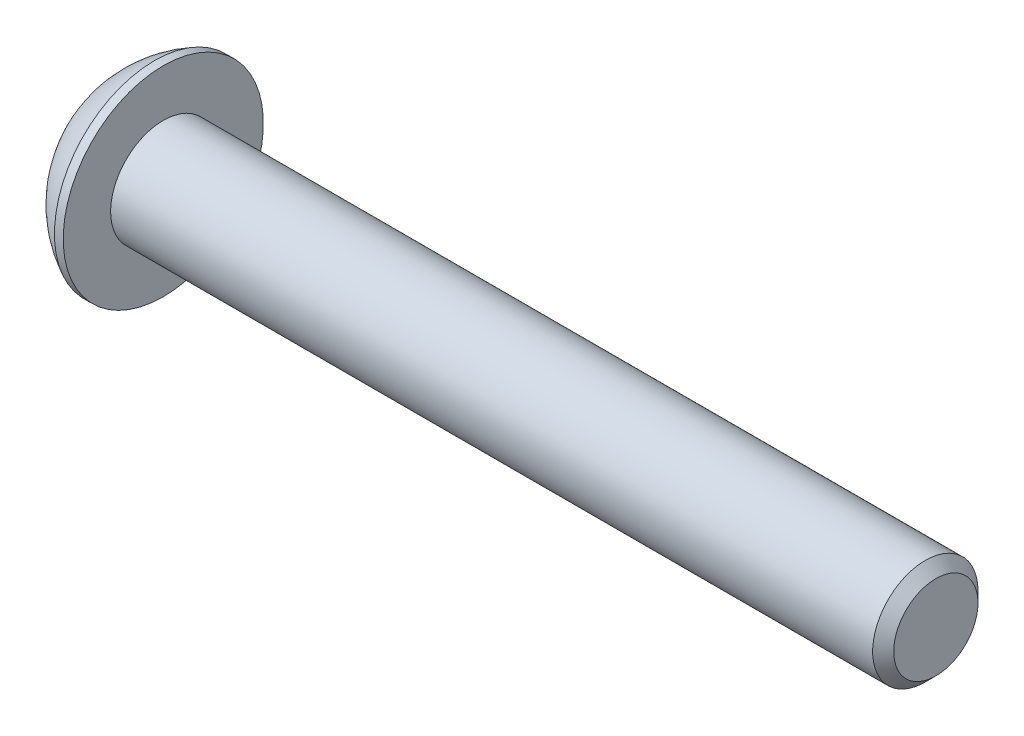
ISO-10303-21;
HEADER;
FILE_DESCRIPTION(('STEP AP214'),'2;1');
FILE_NAME('part.step','',(''),(''),'','','');
FILE_SCHEMA(('AUTOMOTIVE_DESIGN { 1 0 10303 214 1 1 1 1 }'));
ENDSEC;
DATA;
#1=APPLICATION_CONTEXT('core data for automotive mechanical design processes');
#2=APPLICATION_PROTOCOL_DEFINITION('international standard','automotive_design',2000,#1);
#3=PRODUCT_CONTEXT('',#1,'mechanical');
#4=PRODUCT('Part','Part','',(#3));
#5=PRODUCT_RELATED_PRODUCT_CATEGORY('part','',(#4));
#6=PRODUCT_DEFINITION_FORMATION('','',#4);
#7=PRODUCT_DEFINITION_CONTEXT('part definition',#1,'design');
#8=PRODUCT_DEFINITION('design','',#6,#7);
#9=PRODUCT_DEFINITION_SHAPE('','',#8);
#10=(LENGTH_UNIT() NAMED_UNIT(*) SI_UNIT(.MILLI.,.METRE.));
#11=(NAMED_UNIT(*) PLANE_ANGLE_UNIT() SI_UNIT($,.RADIAN.));
#12=(NAMED_UNIT(*) SI_UNIT($,.STERADIAN.) SOLID_ANGLE_UNIT());
#13=UNCERTAINTY_MEASURE_WITH_UNIT(LENGTH_MEASURE(1.E-05),#10,'distance_accuracy_value','');
#14=(GEOMETRIC_REPRESENTATION_CONTEXT(3) GLOBAL_UNCERTAINTY_ASSIGNED_CONTEXT((#13)) GLOBAL_UNIT_ASSIGNED_CONTEXT((#10,
#11,#12)) REPRESENTATION_CONTEXT('',''));
#15=CARTESIAN_POINT('',(0.,0.,0.));
#16=DIRECTION('',(0.,0.,1.));
#17=DIRECTION('',(1.,0.,0.));
#18=AXIS2_PLACEMENT_3D('',#15,#16,#17);
#19=CARTESIAN_POINT('',(-22.,0.,0.));
#20=DIRECTION('',(1.,0.,0.));
#21=DIRECTION('',(0.,0.,-1.));
#22=AXIS2_PLACEMENT_3D('',#19,#20,#21);
#23=CYLINDRICAL_SURFACE('',#22,1.5);
#24=CARTESIAN_POINT('',(-0.300000000000002,0.,0.));
#25=DIRECTION('',(1.,0.,0.));
#26=DIRECTION('',(0.,0.,-1.));
#27=AXIS2_PLACEMENT_3D('',#24,#25,#26);
#28=CIRCLE('',#27,1.5);
#29=CARTESIAN_POINT('',(-0.300000000000002,0.,-1.5));
#30=VERTEX_POINT('',#29);
#31=EDGE_CURVE('E47',#30,#30,#28,.F.);
#32=ORIENTED_EDGE('',*,*,#31,.T.);
#33=EDGE_LOOP('',(#32));
#34=FACE_BOUND('',#33,.T.);
#35=CARTESIAN_POINT('',(-22.,0.,0.));
#36=DIRECTION('',(-1.,0.,0.));
#37=DIRECTION('',(0.,-1.,0.));
#38=AXIS2_PLACEMENT_3D('',#35,#36,#37);
#39=CIRCLE('',#38,1.5);
#40=CARTESIAN_POINT('',(-22.,-1.50000000000001,0.));
#41=VERTEX_POINT('',#40);
#42=EDGE_CURVE('E130',#41,#41,#39,.F.);
#43=ORIENTED_EDGE('',*,*,#42,.T.);
#44=EDGE_LOOP('',(#43));
#45=FACE_BOUND('',#44,.T.);
#46=ADVANCED_FACE('F34',(#34,#45),#23,.T.);
#47=CARTESIAN_POINT('',(0.,0.,0.));
#48=DIRECTION('',(1.,0.,0.));
#49=DIRECTION('',(0.,0.,-1.));
#50=AXIS2_PLACEMENT_3D('',#47,#48,#49);
#51=PLANE('',#50);
#52=CARTESIAN_POINT('',(0.,0.,0.));
#53=DIRECTION('',(1.,0.,0.));
#54=DIRECTION('',(0.,0.,-1.));
#55=AXIS2_PLACEMENT_3D('',#52,#53,#54);
#56=CIRCLE('',#55,1.2);
#57=CARTESIAN_POINT('',(0.,0.,-1.2));
#58=VERTEX_POINT('',#57);
#59=EDGE_CURVE('E134',#58,#58,#56,.T.);
#60=ORIENTED_EDGE('',*,*,#59,.T.);
#61=EDGE_LOOP('',(#60));
#62=FACE_BOUND('',#61,.T.);
#63=ADVANCED_FACE('F149',(#62),#51,.T.);
#64=CARTESIAN_POINT('',(0.,0.,0.));
#65=DIRECTION('',(-1.,0.,0.));
#66=DIRECTION('',(0.,0.,1.));
#67=AXIS2_PLACEMENT_3D('',#64,#65,#66);
#68=CONICAL_SURFACE('',#67,1.2,0.785398163397452);
#69=ORIENTED_EDGE('',*,*,#31,.F.);
#70=EDGE_LOOP('',(#69));
#71=FACE_BOUND('',#70,.T.);
#72=ORIENTED_EDGE('',*,*,#59,.F.);
#73=EDGE_LOOP('',(#72));
#74=FACE_BOUND('',#73,.T.);
#75=ADVANCED_FACE('F36',(#71,#74),#68,.T.);
#76=CARTESIAN_POINT('',(-23.65,0.,0.));
#77=DIRECTION('',(1.,0.,0.));
#78=DIRECTION('',(0.,1.,0.));
#79=AXIS2_PLACEMENT_3D('',#76,#77,#78);
#80=PLANE('',#79);
#81=CARTESIAN_POINT('',(-23.65,0.,0.));
#82=DIRECTION('',(-1.,0.,0.));
#83=DIRECTION('',(0.,-1.,0.));
#84=AXIS2_PLACEMENT_3D('',#81,#82,#83);
#85=CIRCLE('',#84,1.20470053837926);
#86=CARTESIAN_POINT('',(-23.65,-1.20470053837928,0.));
#87=VERTEX_POINT('',#86);
#88=EDGE_CURVE('E372',#87,#87,#85,.T.);
#89=ORIENTED_EDGE('',*,*,#88,.F.);
#90=EDGE_LOOP('',(#89));
#91=FACE_BOUND('',#90,.T.);
#92=CARTESIAN_POINT('',(-23.65,0.,0.));
#93=DIRECTION('',(-1.,0.,0.));
#94=DIRECTION('',(0.,-1.,0.));
#95=AXIS2_PLACEMENT_3D('',#92,#93,#94);
#96=CIRCLE('',#95,1.5);
#97=CARTESIAN_POINT('',(-23.65,-1.5,0.));
#98=VERTEX_POINT('',#97);
#99=EDGE_CURVE('E126',#98,#98,#96,.T.);
#100=ORIENTED_EDGE('',*,*,#99,.T.);
#101=EDGE_LOOP('',(#100));
#102=FACE_BOUND('',#101,.T.);
#103=ADVANCED_FACE('F148',(#91,#102),#80,.F.);
#104=CARTESIAN_POINT('',(-20.8526785714286,0.,0.));
#105=DIRECTION('',(-1.,0.,0.));
#106=DIRECTION('',(0.,1.,0.));
#107=AXIS2_PLACEMENT_3D('',#104,#105,#106);
#108=SPHERICAL_SURFACE('',#107,3.17411517981703);
#109=ORIENTED_EDGE('',*,*,#99,.F.);
#110=EDGE_LOOP('',(#109));
#111=FACE_BOUND('',#110,.T.);
#112=CARTESIAN_POINT('',(-22.25,0.,0.));
#113=DIRECTION('',(-1.,0.,0.));
#114=DIRECTION('',(0.,-1.,0.));
#115=AXIS2_PLACEMENT_3D('',#112,#113,#114);
#116=CIRCLE('',#115,2.85);
#117=CARTESIAN_POINT('',(-22.25,-2.85,0.));
#118=VERTEX_POINT('',#117);
#119=EDGE_CURVE('E122',#118,#118,#116,.T.);
#120=ORIENTED_EDGE('',*,*,#119,.T.);
#121=EDGE_LOOP('',(#120));
#122=FACE_BOUND('',#121,.T.);
#123=ADVANCED_FACE('F160',(#111,#122),#108,.T.);
#124=CARTESIAN_POINT('',(-22.,0.,0.));
#125=DIRECTION('',(-1.,0.,0.));
#126=DIRECTION('',(0.,-1.,0.));
#127=AXIS2_PLACEMENT_3D('',#124,#125,#126);
#128=CYLINDRICAL_SURFACE('',#127,2.85);
#129=ORIENTED_EDGE('',*,*,#119,.F.);
#130=EDGE_LOOP('',(#129));
#131=FACE_BOUND('',#130,.T.);
#132=CARTESIAN_POINT('',(-22.,0.,0.));
#133=DIRECTION('',(-1.,0.,0.));
#134=DIRECTION('',(0.,-1.,0.));
#135=AXIS2_PLACEMENT_3D('',#132,#133,#134);
#136=CIRCLE('',#135,2.85);
#137=CARTESIAN_POINT('',(-22.,-2.85,0.));
#138=VERTEX_POINT('',#137);
#139=EDGE_CURVE('E118',#138,#138,#136,.T.);
#140=ORIENTED_EDGE('',*,*,#139,.T.);
#141=EDGE_LOOP('',(#140));
#142=FACE_BOUND('',#141,.T.);
#143=ADVANCED_FACE('F164',(#131,#142),#128,.T.);
#144=CARTESIAN_POINT('',(-22.,2.85,0.));
#145=DIRECTION('',(-1.,0.,0.));
#146=DIRECTION('',(0.,-1.,0.));
#147=AXIS2_PLACEMENT_3D('',#144,#145,#146);
#148=PLANE('',#147);
#149=ORIENTED_EDGE('',*,*,#42,.F.);
#150=EDGE_LOOP('',(#149));
#151=FACE_BOUND('',#150,.T.);
#152=ORIENTED_EDGE('',*,*,#139,.F.);
#153=EDGE_LOOP('',(#152));
#154=FACE_BOUND('',#153,.T.);
#155=ADVANCED_FACE('F168',(#151,#154),#148,.F.);
#156=CARTESIAN_POINT('',(-23.65,0.,0.));
#157=DIRECTION('',(-1.,0.,0.));
#158=DIRECTION('',(0.,-1.,0.));
#159=AXIS2_PLACEMENT_3D('',#156,#157,#158);
#160=CONICAL_SURFACE('',#159,1.20470053837926,0.78539816339745);
#161=ORIENTED_EDGE('',*,*,#88,.T.);
#162=EDGE_LOOP('',(#161));
#163=FACE_BOUND('',#162,.T.);
#164=CARTESIAN_POINT('',(-24.0125645579163,-1.20678079288098,1.));
#165=CARTESIAN_POINT('',(-23.9901238799752,-1.1776323938094,1.));
#166=CARTESIAN_POINT('',(-23.9678867609271,-1.1483277765504,1.));
#167=CARTESIAN_POINT('',(-23.9239053230859,-1.08934073997342,1.));
#168=CARTESIAN_POINT('',(-23.902161120887,-1.05965823380998,1.));
#169=CARTESIAN_POINT('',(-23.8374858802222,-0.969511619364399,1.));
#170=CARTESIAN_POINT('',(-23.795456442765,-0.908390032886429,1.));
#171=CARTESIAN_POINT('',(-23.7124203349119,-0.779849899214053,1.));
#172=CARTESIAN_POINT('',(-23.6716484956871,-0.71227804773398,1.));
#173=CARTESIAN_POINT('',(-23.5967056855402,-0.573692441836196,1.));
#174=CARTESIAN_POINT('',(-23.5625124208036,-0.502691370033607,1.));
#175=CARTESIAN_POINT('',(-23.5206648240494,-0.396633108483685,1.));
#176=CARTESIAN_POINT('',(-23.508752424601,-0.363265114723113,1.));
#177=CARTESIAN_POINT('',(-23.4876010580815,-0.29567514486371,1.));
#178=CARTESIAN_POINT('',(-23.4783622608543,-0.26145311466105,1.));
#179=CARTESIAN_POINT('',(-23.4632108375931,-0.192964714439445,1.));
#180=CARTESIAN_POINT('',(-23.4572372079353,-0.15871206270245,1.));
#181=CARTESIAN_POINT('',(-23.4487381792859,-0.0897678989598084,1.));
#182=CARTESIAN_POINT('',(-23.4462131691607,-0.0550763379078104,1.));
#183=CARTESIAN_POINT('',(-23.4448308242394,0.0128534343371815,1.));
#184=CARTESIAN_POINT('',(-23.4458171333425,0.0460884918414469,1.));
#185=CARTESIAN_POINT('',(-23.4510428296463,0.112288777523335,1.));
#186=CARTESIAN_POINT('',(-23.4552814228284,0.145254069576908,1.));
#187=CARTESIAN_POINT('',(-23.4668431932388,0.211252641710455,1.));
#188=CARTESIAN_POINT('',(-23.4742213991969,0.244276126106397,1.));
#189=CARTESIAN_POINT('',(-23.4916537633013,0.309593416178887,1.));
#190=CARTESIAN_POINT('',(-23.5017077720937,0.341887262472118,1.));
#191=CARTESIAN_POINT('',(-23.5364692676108,0.441188556116696,1.));
#192=CARTESIAN_POINT('',(-23.5650343603337,0.506841480843466,1.));
#193=CARTESIAN_POINT('',(-23.6286033694253,0.635081389212351,1.));
#194=CARTESIAN_POINT('',(-23.663629955309,0.697656564069511,1.));
#195=CARTESIAN_POINT('',(-23.7359546107891,0.8172743696946,1.));
#196=CARTESIAN_POINT('',(-23.7730556162911,0.874437672313569,1.));
#197=CARTESIAN_POINT('',(-23.8304371678966,0.958655710303473,1.));
#198=CARTESIAN_POINT('',(-23.8497720189249,0.98636616376694,1.));
#199=CARTESIAN_POINT('',(-23.8889602713879,1.04140691974408,1.));
#200=CARTESIAN_POINT('',(-23.908813529201,1.0687373243988,1.));
#201=CARTESIAN_POINT('',(-23.92888195229,1.09590921458868,1.));
#202=B_SPLINE_CURVE_WITH_KNOTS('',3,(#164,#165,#166,#167,#168,#169,#170,#171,#172,#173,#174,
#175,#176,#177,#178,#179,#180,#181,#182,#183,#184,#185,#186,#187,#188,#189,#190,#191,#192,#193,
#194,#195,#196,#197,#198,#199,#200,#201),.UNSPECIFIED.,.F.,.F.,(4,2,2,2,2,2,2,2,2,2,2,2,2,2,2,2,
2,2,4),(0.,0.110355487284534,0.220736811203829,0.443178348562915,0.67975933518112,
0.915523888816468,1.02172703810025,1.1279369325962,1.23208803653003,1.33625088357217,
1.43583459192535,1.53539399546241,1.63677534642524,1.73815103982916,1.95232008261278,
2.16725532249797,2.37159620059983,2.47295962852456,2.57429526618464),.UNSPECIFIED.);
#203=CARTESIAN_POINT('',(-23.6,-0.577350269189646,1.));
#204=VERTEX_POINT('',#203);
#205=CARTESIAN_POINT('',(-23.6,0.577350269189605,1.));
#206=VERTEX_POINT('',#205);
#207=EDGE_CURVE('E102',#204,#206,#202,.T.);
#208=ORIENTED_EDGE('',*,*,#207,.F.);
#209=CARTESIAN_POINT('',(-23.6001154873726,-1.15481600843311,-0.000200000000000284));
#210=CARTESIAN_POINT('',(-23.5802779308257,-1.13496520795028,0.0341825950071803));
#211=CARTESIAN_POINT('',(-23.5616050206389,-1.11478247255944,0.0691401181398242));
#212=CARTESIAN_POINT('',(-23.5274147427231,-1.07362739529221,0.140422802956089));
#213=CARTESIAN_POINT('',(-23.5119164090234,-1.05265113558082,0.176754750528983));
#214=CARTESIAN_POINT('',(-23.4853673071423,-1.01035337909805,0.250016613803311));
#215=CARTESIAN_POINT('',(-23.4742497739969,-0.989042666109261,0.286927851445414));
#216=CARTESIAN_POINT('',(-23.4571198657762,-0.945952199282712,0.361562729310859));
#217=CARTESIAN_POINT('',(-23.4510946974667,-0.924173762626617,0.399284088108635));
#218=CARTESIAN_POINT('',(-23.4456605549675,-0.886641312640035,0.464292198417933));
#219=CARTESIAN_POINT('',(-23.4448569383167,-0.870936130672296,0.491494371528172));
#220=CARTESIAN_POINT('',(-23.4462066994169,-0.839556179862869,0.545846040669111));
#221=CARTESIAN_POINT('',(-23.4483607295472,-0.823881418494944,0.572995523754875));
#222=CARTESIAN_POINT('',(-23.4591169721285,-0.777080970599387,0.65405627732696));
#223=CARTESIAN_POINT('',(-23.4720145564153,-0.746188191116451,0.707564140978427));
#224=CARTESIAN_POINT('',(-23.5031407306022,-0.691968116419669,0.801476065143432));
#225=CARTESIAN_POINT('',(-23.5197377977018,-0.668386557293391,0.842320523671835));
#226=CARTESIAN_POINT('',(-23.5571249246853,-0.622147085933701,0.922409637381944));
#227=CARTESIAN_POINT('',(-23.5779013418174,-0.599486449584595,0.961659010870437));
#228=CARTESIAN_POINT('',(-23.6001154873726,-0.577234799135809,1.0002));
#229=B_SPLINE_CURVE_WITH_KNOTS('',3,(#209,#210,#211,#212,#213,#214,#215,#216,#217,#218,#219,
#220,#221,#222,#223,#224,#225,#226,#227,#228),.UNSPECIFIED.,.F.,.F.,(4,2,2,2,2,2,2,2,2,4),(0.,
0.133237676828558,0.267252229834489,0.399137076269299,0.530689603280767,0.624814864263845,
0.718960890149132,0.907306626112097,1.0571010036179,1.20641411519286),.UNSPECIFIED.);
#230=CARTESIAN_POINT('',(-23.6,-1.15470053837927,0.));
#231=VERTEX_POINT('',#230);
#232=EDGE_CURVE('E210',#231,#204,#229,.T.);
#233=ORIENTED_EDGE('',*,*,#232,.F.);
#234=CARTESIAN_POINT('',(-23.6001154873726,-0.577234799135808,-1.0002));
#235=CARTESIAN_POINT('',(-23.5802779308257,-0.597085599618641,-0.96581740499282));
#236=CARTESIAN_POINT('',(-23.5616050206389,-0.617268335009476,-0.930859881860175));
#237=CARTESIAN_POINT('',(-23.5274147427231,-0.658423412276706,-0.85957719704391));
#238=CARTESIAN_POINT('',(-23.5119164090234,-0.6793996719881,-0.823245249471016));
#239=CARTESIAN_POINT('',(-23.4853673071423,-0.721697428470867,-0.749983386196689));
#240=CARTESIAN_POINT('',(-23.4742497739969,-0.743008141459657,-0.713072148554586));
#241=CARTESIAN_POINT('',(-23.4571198657762,-0.786098608286206,-0.638437270689141));
#242=CARTESIAN_POINT('',(-23.4510946974667,-0.807877044942301,-0.600715911891364));
#243=CARTESIAN_POINT('',(-23.4456605549675,-0.845409494928883,-0.535707801582066));
#244=CARTESIAN_POINT('',(-23.4448569383167,-0.861114676896622,-0.508505628471828));
#245=CARTESIAN_POINT('',(-23.4462066994169,-0.892494627706049,-0.454153959330888));
#246=CARTESIAN_POINT('',(-23.4483607295472,-0.908169389073974,-0.427004476245124));
#247=CARTESIAN_POINT('',(-23.4591169721285,-0.954969836969531,-0.34594372267304));
#248=CARTESIAN_POINT('',(-23.4720145564153,-0.985862616452468,-0.292435859021572));
#249=CARTESIAN_POINT('',(-23.5031407306022,-1.04008269114925,-0.198523934856568));
#250=CARTESIAN_POINT('',(-23.5197377977018,-1.06366425027553,-0.157679476328166));
#251=CARTESIAN_POINT('',(-23.5571249246853,-1.10990372163522,-0.0775903626180571));
#252=CARTESIAN_POINT('',(-23.5779013418174,-1.13256435798432,-0.0383409891295633));
#253=CARTESIAN_POINT('',(-23.6001154873726,-1.15481600843311,0.000199999999999115));
#254=B_SPLINE_CURVE_WITH_KNOTS('',3,(#234,#235,#236,#237,#238,#239,#240,#241,#242,#243,#244,
#245,#246,#247,#248,#249,#250,#251,#252,#253),.UNSPECIFIED.,.F.,.F.,(4,2,2,2,2,2,2,2,2,4),(0.,
0.13323767682856,0.267252229834489,0.399137076269299,0.530689603280768,0.624814864263846,
0.718960890149132,0.907306626112097,1.05710100361789,1.20641411519286),.UNSPECIFIED.);
#255=CARTESIAN_POINT('',(-23.6,-0.577350269189646,-1.));
#256=VERTEX_POINT('',#255);
#257=EDGE_CURVE('E205',#256,#231,#254,.T.);
#258=ORIENTED_EDGE('',*,*,#257,.F.);
#259=CARTESIAN_POINT('',(-24.0125650614172,-1.20678144678533,-1.));
#260=CARTESIAN_POINT('',(-23.9901243639822,-1.17763302882146,-1.));
#261=CARTESIAN_POINT('',(-23.9678872254711,-1.14832839261354,-1.));
#262=CARTESIAN_POINT('',(-23.9239057488155,-1.08934131795807,-1.));
#263=CARTESIAN_POINT('',(-23.9021615272652,-1.059658792665,-1.));
#264=CARTESIAN_POINT('',(-23.837486228163,-0.969512119697562,-1.));
#265=CARTESIAN_POINT('',(-23.7954567519025,-0.908390493450879,-1.));
#266=CARTESIAN_POINT('',(-23.7124205639502,-0.779850272991524,-1.));
#267=CARTESIAN_POINT('',(-23.67164868372,-0.712278374260663,-1.));
#268=CARTESIAN_POINT('',(-23.5967057974366,-0.573692669877708,-1.));
#269=CARTESIAN_POINT('',(-23.5625124975185,-0.502691546874024,-1.));
#270=CARTESIAN_POINT('',(-23.5206648756311,-0.396633247078009,-1.));
#271=CARTESIAN_POINT('',(-23.5087524781389,-0.363265269879175,-1.));
#272=CARTESIAN_POINT('',(-23.4876011122146,-0.295675333788417,-1.));
#273=CARTESIAN_POINT('',(-23.4783623136284,-0.261453320792008,-1.));
#274=CARTESIAN_POINT('',(-23.4632108836686,-0.192964954456364,-1.));
#275=CARTESIAN_POINT('',(-23.4572372487852,-0.158712319385996,-1.));
#276=CARTESIAN_POINT('',(-23.4487382057865,-0.0897681885430111,-1.));
#277=CARTESIAN_POINT('',(-23.446213186537,-0.05507664372401,-1.));
#278=CARTESIAN_POINT('',(-23.4448308203586,0.0128531008985226,-1.));
#279=CARTESIAN_POINT('',(-23.445817117779,0.0460881469709354,-1.));
#280=CARTESIAN_POINT('',(-23.4510427890575,0.112288411077507,-1.));
#281=CARTESIAN_POINT('',(-23.4552813688957,0.14525369298744,-1.));
#282=CARTESIAN_POINT('',(-23.4668431114854,0.211252245100392,-1.));
#283=CARTESIAN_POINT('',(-23.474221302878,0.244275719655881,-1.));
#284=CARTESIAN_POINT('',(-23.4916536376949,0.309592991103803,-1.));
#285=CARTESIAN_POINT('',(-23.5017076317658,0.341886828612767,-1.));
#286=CARTESIAN_POINT('',(-23.5364690589811,0.441188030105094,-1.));
#287=CARTESIAN_POINT('',(-23.5650340890574,0.506840876086047,-1.));
#288=CARTESIAN_POINT('',(-23.6286029659001,0.635080633024404,-1.));
#289=CARTESIAN_POINT('',(-23.663629482132,0.697655735233984,-1.));
#290=CARTESIAN_POINT('',(-23.7359540043354,0.817273410459762,-1.));
#291=CARTESIAN_POINT('',(-23.7730549468408,0.874436654853316,-1.));
#292=CARTESIAN_POINT('',(-23.8304364042781,0.958654606765343,-1.));
#293=CARTESIAN_POINT('',(-23.8497712241667,0.98636503195223,-1.));
#294=CARTESIAN_POINT('',(-23.8889594143893,1.04140573156298,-1.));
#295=CARTESIAN_POINT('',(-23.9088126411017,1.06873610812793,-1.));
#296=CARTESIAN_POINT('',(-23.9288810331298,1.09590797027906,-1.));
#297=B_SPLINE_CURVE_WITH_KNOTS('',3,(#259,#260,#261,#262,#263,#264,#265,#266,#267,#268,#269,
#270,#271,#272,#273,#274,#275,#276,#277,#278,#279,#280,#281,#282,#283,#284,#285,#286,#287,#288,
#289,#290,#291,#292,#293,#294,#295,#296),.UNSPECIFIED.,.F.,.F.,(4,2,2,2,2,2,2,2,2,2,2,2,2,2,2,2,
2,2,4),(0.,0.110355567866854,0.220736972391891,0.44317867397924,0.679759845471899,
0.915524582194851,1.02172768288056,1.12793752886233,1.23208858652571,1.33625138728838,
1.43583506047458,1.53539442879914,1.63677574143709,1.73815139653142,1.95232014898535,
2.16725509662759,2.3715957252827,2.47295903017567,2.57429454481414),.UNSPECIFIED.);
#298=CARTESIAN_POINT('',(-23.6,0.577350269189606,-1.));
#299=VERTEX_POINT('',#298);
#300=EDGE_CURVE('E54',#299,#256,#297,.F.);
#301=ORIENTED_EDGE('',*,*,#300,.F.);
#302=CARTESIAN_POINT('',(-23.6001154873726,1.15481600843307,0.000200000000000217));
#303=CARTESIAN_POINT('',(-23.5802779308257,1.13496520795024,-0.0341825950071804));
#304=CARTESIAN_POINT('',(-23.5616050206389,1.1147824725594,-0.0691401181398242));
#305=CARTESIAN_POINT('',(-23.5274147427231,1.07362739529217,-0.140422802956089));
#306=CARTESIAN_POINT('',(-23.5119164090234,1.05265113558078,-0.176754750528983));
#307=CARTESIAN_POINT('',(-23.4853673071423,1.01035337909801,-0.25001661380331));
#308=CARTESIAN_POINT('',(-23.4742497739969,0.98904266610922,-0.286927851445414));
#309=CARTESIAN_POINT('',(-23.4571198657762,0.945952199282671,-0.361562729310859));
#310=CARTESIAN_POINT('',(-23.4510946974667,0.924173762626576,-0.399284088108635));
#311=CARTESIAN_POINT('',(-23.4456605549675,0.886641312639994,-0.464292198417933));
#312=CARTESIAN_POINT('',(-23.4448569383167,0.870936130672255,-0.491494371528172));
#313=CARTESIAN_POINT('',(-23.4462066994169,0.839556179862828,-0.545846040669112));
#314=CARTESIAN_POINT('',(-23.4483607295472,0.823881418494903,-0.572995523754875));
#315=CARTESIAN_POINT('',(-23.4591169721285,0.777080970599346,-0.65405627732696));
#316=CARTESIAN_POINT('',(-23.4720145564153,0.74618819111641,-0.707564140978427));
#317=CARTESIAN_POINT('',(-23.5031407306022,0.691968116419629,-0.801476065143431));
#318=CARTESIAN_POINT('',(-23.5197377977018,0.668386557293351,-0.842320523671834));
#319=CARTESIAN_POINT('',(-23.5571249246853,0.622147085933661,-0.922409637381944));
#320=CARTESIAN_POINT('',(-23.5779013418174,0.599486449584555,-0.961659010870438));
#321=CARTESIAN_POINT('',(-23.6001154873726,0.577234799135768,-1.0002));
#322=B_SPLINE_CURVE_WITH_KNOTS('',3,(#302,#303,#304,#305,#306,#307,#308,#309,#310,#311,#312,
#313,#314,#315,#316,#317,#318,#319,#320,#321),.UNSPECIFIED.,.F.,.F.,(4,2,2,2,2,2,2,2,2,4),(0.,
0.133237676828557,0.267252229834489,0.399137076269299,0.530689603280767,0.624814864263845,
0.718960890149132,0.907306626112097,1.05710100361789,1.20641411519286),.UNSPECIFIED.);
#323=CARTESIAN_POINT('',(-23.6,1.15470053837923,0.));
#324=VERTEX_POINT('',#323);
#325=EDGE_CURVE('E11',#324,#299,#322,.T.);
#326=ORIENTED_EDGE('',*,*,#325,.F.);
#327=CARTESIAN_POINT('',(-23.6001154873726,0.577234799135767,1.0002));
#328=CARTESIAN_POINT('',(-23.5802779308257,0.5970855996186,0.96581740499282));
#329=CARTESIAN_POINT('',(-23.5616050206389,0.617268335009435,0.930859881860176));
#330=CARTESIAN_POINT('',(-23.5274147427231,0.658423412276665,0.859577197043911));
#331=CARTESIAN_POINT('',(-23.5119164090234,0.679399671988059,0.823245249471016));
#332=CARTESIAN_POINT('',(-23.4853673071423,0.721697428470826,0.749983386196689));
#333=CARTESIAN_POINT('',(-23.4742497739969,0.743008141459616,0.713072148554586));
#334=CARTESIAN_POINT('',(-23.4571198657762,0.786098608286166,0.638437270689141));
#335=CARTESIAN_POINT('',(-23.4510946974667,0.807877044942261,0.600715911891364));
#336=CARTESIAN_POINT('',(-23.4456605549675,0.845409494928843,0.535707801582066));
#337=CARTESIAN_POINT('',(-23.4448569383167,0.861114676896582,0.508505628471827));
#338=CARTESIAN_POINT('',(-23.4462066994169,0.892494627706009,0.454153959330887));
#339=CARTESIAN_POINT('',(-23.4483607295472,0.908169389073934,0.427004476245123));
#340=CARTESIAN_POINT('',(-23.4591169721285,0.954969836969491,0.345943722673039));
#341=CARTESIAN_POINT('',(-23.4720145564153,0.985862616452427,0.292435859021572));
#342=CARTESIAN_POINT('',(-23.5031407306022,1.04008269114921,0.198523934856567));
#343=CARTESIAN_POINT('',(-23.5197377977018,1.06366425027549,0.157679476328164));
#344=CARTESIAN_POINT('',(-23.5571249246853,1.10990372163518,0.0775903626180551));
#345=CARTESIAN_POINT('',(-23.5779013418174,1.13256435798428,0.038340989129562));
#346=CARTESIAN_POINT('',(-23.6001154873726,1.15481600843307,-0.000199999999999525));
#347=B_SPLINE_CURVE_WITH_KNOTS('',3,(#327,#328,#329,#330,#331,#332,#333,#334,#335,#336,#337,
#338,#339,#340,#341,#342,#343,#344,#345,#346),.UNSPECIFIED.,.F.,.F.,(4,2,2,2,2,2,2,2,2,4),(0.,
0.133237676828559,0.267252229834489,0.399137076269299,0.530689603280768,0.624814864263846,
0.718960890149133,0.907306626112098,1.0571010036179,1.20641411519286),.UNSPECIFIED.);
#348=EDGE_CURVE('E92',#206,#324,#347,.T.);
#349=ORIENTED_EDGE('',*,*,#348,.F.);
#350=EDGE_LOOP('',(#208,#233,#258,#301,#326,#349));
#351=FACE_BOUND('',#350,.T.);
#352=ADVANCED_FACE('F91',(#163,#351),#160,.F.);
#353=CARTESIAN_POINT('',(-22.45,0.,0.));
#354=DIRECTION('',(-1.,0.,0.));
#355=DIRECTION('',(0.,0.,1.));
#356=AXIS2_PLACEMENT_3D('',#353,#354,#355);
#357=PLANE('',#356);
#358=DIRECTION('',(0.,0.5,-0.866025403784439));
#359=VECTOR('',#358,1.);
#360=CARTESIAN_POINT('',(-22.45,0.577350269189605,1.));
#361=LINE('',#360,#359);
#362=CARTESIAN_POINT('',(-22.45,0.577350269189605,1.));
#363=VERTEX_POINT('',#362);
#364=CARTESIAN_POINT('',(-22.45,1.15470053837923,0.));
#365=VERTEX_POINT('',#364);
#366=EDGE_CURVE('E101',#363,#365,#361,.T.);
#367=ORIENTED_EDGE('',*,*,#366,.T.);
#368=DIRECTION('',(0.,-0.5,-0.866025403784439));
#369=VECTOR('',#368,1.);
#370=CARTESIAN_POINT('',(-22.45,1.15470053837923,0.));
#371=LINE('',#370,#369);
#372=CARTESIAN_POINT('',(-22.45,0.577350269189605,-1.));
#373=VERTEX_POINT('',#372);
#374=EDGE_CURVE('E106',#365,#373,#371,.T.);
#375=ORIENTED_EDGE('',*,*,#374,.T.);
#376=DIRECTION('',(0.,-1.,0.));
#377=VECTOR('',#376,1.);
#378=CARTESIAN_POINT('',(-22.45,0.577350269189605,-1.));
#379=LINE('',#378,#377);
#380=CARTESIAN_POINT('',(-22.45,-0.577350269189646,-1.));
#381=VERTEX_POINT('',#380);
#382=EDGE_CURVE('E236',#373,#381,#379,.T.);
#383=ORIENTED_EDGE('',*,*,#382,.T.);
#384=DIRECTION('',(0.,-0.5,0.866025403784438));
#385=VECTOR('',#384,1.);
#386=CARTESIAN_POINT('',(-22.45,-0.577350269189646,-1.));
#387=LINE('',#386,#385);
#388=CARTESIAN_POINT('',(-22.45,-1.15470053837927,0.));
#389=VERTEX_POINT('',#388);
#390=EDGE_CURVE('E241',#381,#389,#387,.T.);
#391=ORIENTED_EDGE('',*,*,#390,.T.);
#392=DIRECTION('',(0.,0.5,0.866025403784439));
#393=VECTOR('',#392,1.);
#394=CARTESIAN_POINT('',(-22.45,-1.15470053837927,0.));
#395=LINE('',#394,#393);
#396=CARTESIAN_POINT('',(-22.45,-0.577350269189647,1.));
#397=VERTEX_POINT('',#396);
#398=EDGE_CURVE('E114',#389,#397,#395,.T.);
#399=ORIENTED_EDGE('',*,*,#398,.T.);
#400=DIRECTION('',(0.,1.,0.));
#401=VECTOR('',#400,1.);
#402=CARTESIAN_POINT('',(-22.45,-0.577350269189647,1.));
#403=LINE('',#402,#401);
#404=EDGE_CURVE('E109',#397,#363,#403,.T.);
#405=ORIENTED_EDGE('',*,*,#404,.T.);
#406=EDGE_LOOP('',(#367,#375,#383,#391,#399,#405));
#407=FACE_BOUND('',#406,.T.);
#408=ADVANCED_FACE('F192',(#407),#357,.T.);
#409=CARTESIAN_POINT('',(-22.45,1.15470053837923,0.));
#410=DIRECTION('',(0.,0.866025403784439,-0.5));
#411=DIRECTION('',(0.,0.5,0.866025403784439));
#412=AXIS2_PLACEMENT_3D('',#409,#410,#411);
#413=PLANE('',#412);
#414=DIRECTION('',(-1.,0.,0.));
#415=VECTOR('',#414,1.);
#416=CARTESIAN_POINT('',(-22.45,1.15470053837923,0.));
#417=LINE('',#416,#415);
#418=EDGE_CURVE('E98',#365,#324,#417,.T.);
#419=ORIENTED_EDGE('',*,*,#418,.T.);
#420=ORIENTED_EDGE('',*,*,#325,.T.);
#421=DIRECTION('',(-1.,0.,0.));
#422=VECTOR('',#421,1.);
#423=CARTESIAN_POINT('',(-22.45,0.577350269189605,-1.));
#424=LINE('',#423,#422);
#425=EDGE_CURVE('E108',#373,#299,#424,.T.);
#426=ORIENTED_EDGE('',*,*,#425,.F.);
#427=ORIENTED_EDGE('',*,*,#374,.F.);
#428=EDGE_LOOP('',(#419,#420,#426,#427));
#429=FACE_BOUND('',#428,.T.);
#430=ADVANCED_FACE('F104',(#429),#413,.F.);
#431=CARTESIAN_POINT('',(-22.45,0.577350269189605,-1.));
#432=DIRECTION('',(0.,0.,-1.));
#433=DIRECTION('',(0.,1.,0.));
#434=AXIS2_PLACEMENT_3D('',#431,#432,#433);
#435=PLANE('',#434);
#436=ORIENTED_EDGE('',*,*,#425,.T.);
#437=ORIENTED_EDGE('',*,*,#300,.T.);
#438=DIRECTION('',(-1.,0.,0.));
#439=VECTOR('',#438,1.);
#440=CARTESIAN_POINT('',(-22.45,-0.577350269189646,-1.));
#441=LINE('',#440,#439);
#442=EDGE_CURVE('E111',#381,#256,#441,.T.);
#443=ORIENTED_EDGE('',*,*,#442,.F.);
#444=ORIENTED_EDGE('',*,*,#382,.F.);
#445=EDGE_LOOP('',(#436,#437,#443,#444));
#446=FACE_BOUND('',#445,.T.);
#447=ADVANCED_FACE('F225',(#446),#435,.F.);
#448=CARTESIAN_POINT('',(-22.45,-0.577350269189646,-1.));
#449=DIRECTION('',(0.,-0.866025403784439,-0.5));
#450=DIRECTION('',(0.,0.5,-0.866025403784439));
#451=AXIS2_PLACEMENT_3D('',#448,#449,#450);
#452=PLANE('',#451);
#453=ORIENTED_EDGE('',*,*,#442,.T.);
#454=ORIENTED_EDGE('',*,*,#257,.T.);
#455=DIRECTION('',(-1.,0.,0.));
#456=VECTOR('',#455,1.);
#457=CARTESIAN_POINT('',(-22.45,-1.15470053837927,0.));
#458=LINE('',#457,#456);
#459=EDGE_CURVE('E258',#389,#231,#458,.T.);
#460=ORIENTED_EDGE('',*,*,#459,.F.);
#461=ORIENTED_EDGE('',*,*,#390,.F.);
#462=EDGE_LOOP('',(#453,#454,#460,#461));
#463=FACE_BOUND('',#462,.T.);
#464=ADVANCED_FACE('F220',(#463),#452,.F.);
#465=CARTESIAN_POINT('',(-22.45,-1.15470053837927,0.));
#466=DIRECTION('',(0.,-0.866025403784439,0.5));
#467=DIRECTION('',(0.,-0.5,-0.866025403784439));
#468=AXIS2_PLACEMENT_3D('',#465,#466,#467);
#469=PLANE('',#468);
#470=ORIENTED_EDGE('',*,*,#459,.T.);
#471=ORIENTED_EDGE('',*,*,#232,.T.);
#472=DIRECTION('',(-1.,0.,0.));
#473=VECTOR('',#472,1.);
#474=CARTESIAN_POINT('',(-22.45,-0.577350269189647,1.));
#475=LINE('',#474,#473);
#476=EDGE_CURVE('E255',#397,#204,#475,.T.);
#477=ORIENTED_EDGE('',*,*,#476,.F.);
#478=ORIENTED_EDGE('',*,*,#398,.F.);
#479=EDGE_LOOP('',(#470,#471,#477,#478));
#480=FACE_BOUND('',#479,.T.);
#481=ADVANCED_FACE('F217',(#480),#469,.F.);
#482=CARTESIAN_POINT('',(-22.45,-0.577350269189647,1.));
#483=DIRECTION('',(0.,0.,1.));
#484=DIRECTION('',(1.,0.,0.));
#485=AXIS2_PLACEMENT_3D('',#482,#483,#484);
#486=PLANE('',#485);
#487=ORIENTED_EDGE('',*,*,#476,.T.);
#488=ORIENTED_EDGE('',*,*,#207,.T.);
#489=DIRECTION('',(-1.,0.,0.));
#490=VECTOR('',#489,1.);
#491=CARTESIAN_POINT('',(-22.45,0.577350269189605,1.));
#492=LINE('',#491,#490);
#493=EDGE_CURVE('E61',#363,#206,#492,.T.);
#494=ORIENTED_EDGE('',*,*,#493,.F.);
#495=ORIENTED_EDGE('',*,*,#404,.F.);
#496=EDGE_LOOP('',(#487,#488,#494,#495));
#497=FACE_BOUND('',#496,.T.);
#498=ADVANCED_FACE('F175',(#497),#486,.F.);
#499=CARTESIAN_POINT('',(-22.45,0.577350269189605,1.));
#500=DIRECTION('',(0.,0.866025403784439,0.5));
#501=DIRECTION('',(0.,-0.5,0.866025403784439));
#502=AXIS2_PLACEMENT_3D('',#499,#500,#501);
#503=PLANE('',#502);
#504=ORIENTED_EDGE('',*,*,#493,.T.);
#505=ORIENTED_EDGE('',*,*,#348,.T.);
#506=ORIENTED_EDGE('',*,*,#418,.F.);
#507=ORIENTED_EDGE('',*,*,#366,.F.);
#508=EDGE_LOOP('',(#504,#505,#506,#507));
#509=FACE_BOUND('',#508,.T.);
#510=ADVANCED_FACE('F97',(#509),#503,.F.);
#511=CLOSED_SHELL('',(#46,#63,#75,#103,#123,#143,#155,#352,#408,#430,#447,#464,#481,#498,#510));
#512=MANIFOLD_SOLID_BREP('B2',#511);
#513=ADVANCED_BREP_SHAPE_REPRESENTATION('',(#18,#512),#14);
#514=SHAPE_DEFINITION_REPRESENTATION(#9,#513);
ENDSEC;
END-ISO-10303-21;
